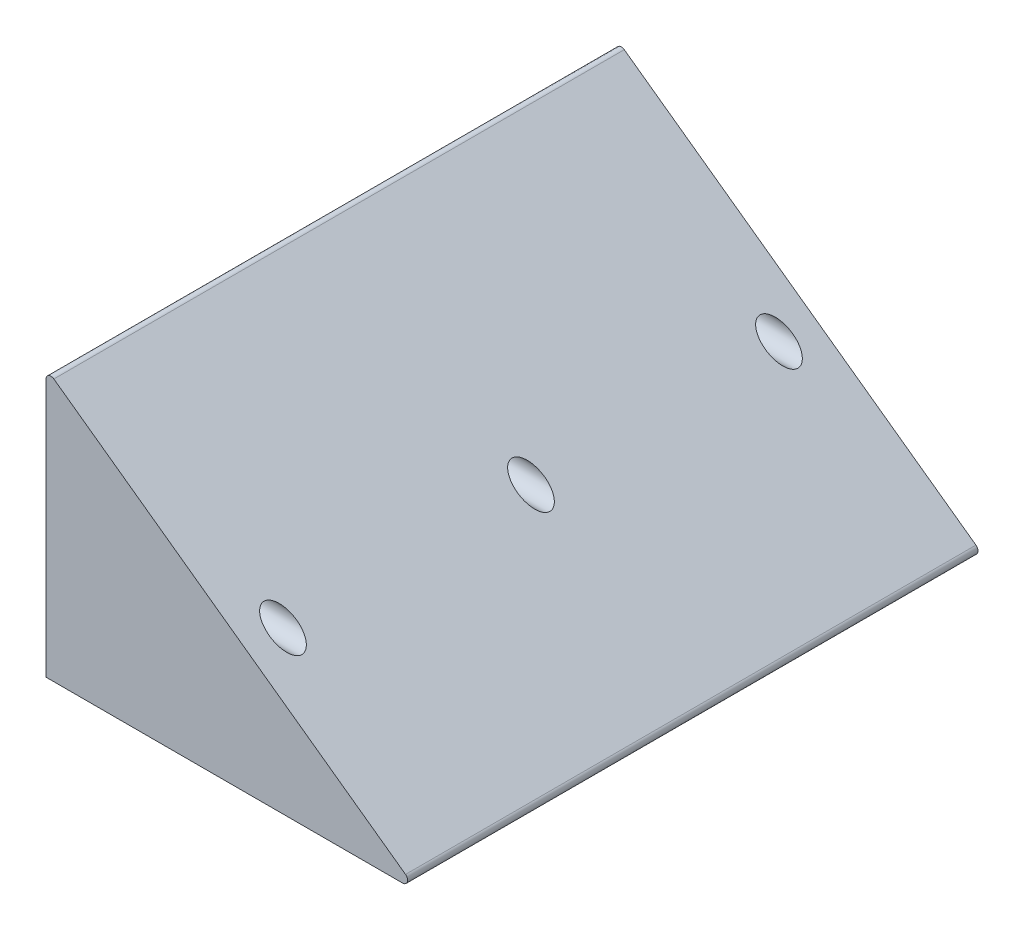
ISO-10303-21;
HEADER;
FILE_DESCRIPTION(('STEP AP214'),'2;1');
FILE_NAME('part.step','',(''),(''),'','','');
FILE_SCHEMA(('AUTOMOTIVE_DESIGN { 1 0 10303 214 1 1 1 1 }'));
ENDSEC;
DATA;
#1=APPLICATION_CONTEXT('core data for automotive mechanical design processes');
#2=APPLICATION_PROTOCOL_DEFINITION('international standard','automotive_design',2000,#1);
#3=PRODUCT_CONTEXT('',#1,'mechanical');
#4=PRODUCT('Part','Part','',(#3));
#5=PRODUCT_RELATED_PRODUCT_CATEGORY('part','',(#4));
#6=PRODUCT_DEFINITION_FORMATION('','',#4);
#7=PRODUCT_DEFINITION_CONTEXT('part definition',#1,'design');
#8=PRODUCT_DEFINITION('design','',#6,#7);
#9=PRODUCT_DEFINITION_SHAPE('','',#8);
#10=(LENGTH_UNIT() NAMED_UNIT(*) SI_UNIT(.MILLI.,.METRE.));
#11=(NAMED_UNIT(*) PLANE_ANGLE_UNIT() SI_UNIT($,.RADIAN.));
#12=(NAMED_UNIT(*) SI_UNIT($,.STERADIAN.) SOLID_ANGLE_UNIT());
#13=UNCERTAINTY_MEASURE_WITH_UNIT(LENGTH_MEASURE(1.E-05),#10,'distance_accuracy_value','');
#14=(GEOMETRIC_REPRESENTATION_CONTEXT(3) GLOBAL_UNCERTAINTY_ASSIGNED_CONTEXT((#13)) GLOBAL_UNIT_ASSIGNED_CONTEXT((#10,
#11,#12)) REPRESENTATION_CONTEXT('',''));
#15=CARTESIAN_POINT('',(0.,0.,0.));
#16=DIRECTION('',(0.,0.,1.));
#17=DIRECTION('',(1.,0.,0.));
#18=AXIS2_PLACEMENT_3D('',#15,#16,#17);
#19=CARTESIAN_POINT('',(0.,0.,-230.));
#20=DIRECTION('',(0.,-1.,0.));
#21=DIRECTION('',(0.,0.,-1.));
#22=AXIS2_PLACEMENT_3D('',#19,#20,#21);
#23=PLANE('',#22);
#24=DIRECTION('',(1.,0.,0.));
#25=VECTOR('',#24,1.);
#26=CARTESIAN_POINT('',(0.,0.,0.));
#27=LINE('',#26,#25);
#28=CARTESIAN_POINT('',(0.,0.,0.));
#29=VERTEX_POINT('',#28);
#30=CARTESIAN_POINT('',(143.799350710944,0.,0.));
#31=VERTEX_POINT('',#30);
#32=EDGE_CURVE('E119',#29,#31,#27,.T.);
#33=ORIENTED_EDGE('',*,*,#32,.F.);
#34=DIRECTION('',(0.,0.,1.));
#35=VECTOR('',#34,1.);
#36=CARTESIAN_POINT('',(0.,0.,-230.));
#37=LINE('',#36,#35);
#38=CARTESIAN_POINT('',(0.,0.,-230.));
#39=VERTEX_POINT('',#38);
#40=EDGE_CURVE('E11',#39,#29,#37,.T.);
#41=ORIENTED_EDGE('',*,*,#40,.F.);
#42=DIRECTION('',(1.,0.,0.));
#43=VECTOR('',#42,1.);
#44=CARTESIAN_POINT('',(0.,0.,-230.));
#45=LINE('',#44,#43);
#46=CARTESIAN_POINT('',(143.799350710944,0.,-230.));
#47=VERTEX_POINT('',#46);
#48=EDGE_CURVE('E114',#39,#47,#45,.T.);
#49=ORIENTED_EDGE('',*,*,#48,.T.);
#50=DIRECTION('',(0.,0.,1.));
#51=VECTOR('',#50,1.);
#52=CARTESIAN_POINT('',(143.799350710944,0.,-230.));
#53=LINE('',#52,#51);
#54=EDGE_CURVE('E87',#47,#31,#53,.T.);
#55=ORIENTED_EDGE('',*,*,#54,.T.);
#56=EDGE_LOOP('',(#33,#41,#49,#55));
#57=FACE_BOUND('',#56,.T.);
#58=ADVANCED_FACE('F39',(#57),#23,.T.);
#59=CARTESIAN_POINT('',(0.,104.09553251188,-230.));
#60=DIRECTION('',(-1.,0.,0.));
#61=DIRECTION('',(0.,-1.,0.));
#62=AXIS2_PLACEMENT_3D('',#59,#60,#61);
#63=PLANE('',#62);
#64=CARTESIAN_POINT('',(0.,50.,-15.));
#65=DIRECTION('',(1.,0.,0.));
#66=DIRECTION('',(0.,0.,-1.));
#67=AXIS2_PLACEMENT_3D('',#64,#65,#66);
#68=CIRCLE('',#67,3.29999999999995);
#69=CARTESIAN_POINT('',(0.,50.,-18.3));
#70=VERTEX_POINT('',#69);
#71=EDGE_CURVE('E237',#70,#70,#68,.T.);
#72=ORIENTED_EDGE('',*,*,#71,.T.);
#73=EDGE_LOOP('',(#72));
#74=FACE_BOUND('',#73,.T.);
#75=CARTESIAN_POINT('',(0.,50.,-115.));
#76=DIRECTION('',(1.,0.,0.));
#77=DIRECTION('',(0.,0.,-1.));
#78=AXIS2_PLACEMENT_3D('',#75,#76,#77);
#79=CIRCLE('',#78,3.29999999999995);
#80=CARTESIAN_POINT('',(0.,50.,-118.3));
#81=VERTEX_POINT('',#80);
#82=EDGE_CURVE('E144',#81,#81,#79,.T.);
#83=ORIENTED_EDGE('',*,*,#82,.T.);
#84=EDGE_LOOP('',(#83));
#85=FACE_BOUND('',#84,.T.);
#86=CARTESIAN_POINT('',(0.,50.,-215.));
#87=DIRECTION('',(1.,0.,0.));
#88=DIRECTION('',(0.,0.,-1.));
#89=AXIS2_PLACEMENT_3D('',#86,#87,#88);
#90=CIRCLE('',#89,3.29999999999995);
#91=CARTESIAN_POINT('',(0.,50.,-218.3));
#92=VERTEX_POINT('',#91);
#93=EDGE_CURVE('E139',#92,#92,#90,.T.);
#94=ORIENTED_EDGE('',*,*,#93,.T.);
#95=EDGE_LOOP('',(#94));
#96=FACE_BOUND('',#95,.T.);
#97=DIRECTION('',(0.,-1.,0.));
#98=VECTOR('',#97,1.);
#99=CARTESIAN_POINT('',(0.,104.09553251188,0.));
#100=LINE('',#99,#98);
#101=CARTESIAN_POINT('',(0.,104.09553251188,0.));
#102=VERTEX_POINT('',#101);
#103=EDGE_CURVE('E129',#102,#29,#100,.T.);
#104=ORIENTED_EDGE('',*,*,#103,.F.);
#105=DIRECTION('',(0.,0.,1.));
#106=VECTOR('',#105,1.);
#107=CARTESIAN_POINT('',(0.,104.09553251188,-230.));
#108=LINE('',#107,#106);
#109=CARTESIAN_POINT('',(0.,104.09553251188,-230.));
#110=VERTEX_POINT('',#109);
#111=EDGE_CURVE('E49',#110,#102,#108,.T.);
#112=ORIENTED_EDGE('',*,*,#111,.F.);
#113=DIRECTION('',(0.,-1.,0.));
#114=VECTOR('',#113,1.);
#115=CARTESIAN_POINT('',(0.,104.09553251188,-230.));
#116=LINE('',#115,#114);
#117=EDGE_CURVE('E109',#110,#39,#116,.T.);
#118=ORIENTED_EDGE('',*,*,#117,.T.);
#119=ORIENTED_EDGE('',*,*,#40,.T.);
#120=EDGE_LOOP('',(#104,#112,#118,#119));
#121=FACE_BOUND('',#120,.T.);
#122=ADVANCED_FACE('F165',(#74,#85,#96,#121),#63,.T.);
#123=CARTESIAN_POINT('',(2.,104.09553251188,-230.));
#124=DIRECTION('',(0.,0.,1.));
#125=DIRECTION('',(1.,0.,0.));
#126=AXIS2_PLACEMENT_3D('',#123,#124,#125);
#127=CYLINDRICAL_SURFACE('',#126,2.);
#128=CARTESIAN_POINT('',(2.,104.09553251188,0.));
#129=DIRECTION('',(0.,0.,1.));
#130=DIRECTION('',(-1.,0.,0.));
#131=AXIS2_PLACEMENT_3D('',#128,#129,#130);
#132=CIRCLE('',#131,2.);
#133=CARTESIAN_POINT('',(3.16860945169017,105.718601194783,0.));
#134=VERTEX_POINT('',#133);
#135=EDGE_CURVE('E97',#134,#102,#132,.T.);
#136=ORIENTED_EDGE('',*,*,#135,.F.);
#137=DIRECTION('',(0.,0.,1.));
#138=VECTOR('',#137,1.);
#139=CARTESIAN_POINT('',(3.16860945169017,105.718601194783,-230.));
#140=LINE('',#139,#138);
#141=CARTESIAN_POINT('',(3.16860945169017,105.718601194783,-230.));
#142=VERTEX_POINT('',#141);
#143=EDGE_CURVE('E92',#142,#134,#140,.T.);
#144=ORIENTED_EDGE('',*,*,#143,.F.);
#145=CARTESIAN_POINT('',(2.,104.09553251188,-230.));
#146=DIRECTION('',(0.,0.,1.));
#147=DIRECTION('',(-1.,0.,0.));
#148=AXIS2_PLACEMENT_3D('',#145,#146,#147);
#149=CIRCLE('',#148,2.);
#150=EDGE_CURVE('E95',#142,#110,#149,.T.);
#151=ORIENTED_EDGE('',*,*,#150,.T.);
#152=ORIENTED_EDGE('',*,*,#111,.T.);
#153=EDGE_LOOP('',(#136,#144,#151,#152));
#154=FACE_BOUND('',#153,.T.);
#155=ADVANCED_FACE('F94',(#154),#127,.T.);
#156=CARTESIAN_POINT('',(144.967960162635,3.62306868290303,-230.));
#157=DIRECTION('',(0.584304725845076,0.811534341451494,0.));
#158=DIRECTION('',(-0.811534341451495,0.584304725845076,0.));
#159=AXIS2_PLACEMENT_3D('',#156,#157,#158);
#160=PLANE('',#159);
#161=CARTESIAN_POINT('',(80.5555555555555,50.,-15.));
#162=DIRECTION('',(0.584304725845076,0.811534341451494,0.));
#163=DIRECTION('',(0.811534341451495,-0.584304725845076,0.));
#164=AXIS2_PLACEMENT_3D('',#161,#162,#163);
#165=ELLIPSE('',#164,9.41289665601348,5.49999999999999);
#166=CARTESIAN_POINT('',(88.1944444444444,44.5,-15.));
#167=VERTEX_POINT('',#166);
#168=EDGE_CURVE('E42',#167,#167,#165,.T.);
#169=ORIENTED_EDGE('',*,*,#168,.F.);
#170=EDGE_LOOP('',(#169));
#171=FACE_BOUND('',#170,.T.);
#172=CARTESIAN_POINT('',(80.5555555555555,50.,-115.));
#173=DIRECTION('',(0.584304725845076,0.811534341451494,0.));
#174=DIRECTION('',(0.811534341451495,-0.584304725845076,0.));
#175=AXIS2_PLACEMENT_3D('',#172,#173,#174);
#176=ELLIPSE('',#175,9.41289665601348,5.49999999999999);
#177=CARTESIAN_POINT('',(88.1944444444444,44.5,-115.));
#178=VERTEX_POINT('',#177);
#179=EDGE_CURVE('E140',#178,#178,#176,.T.);
#180=ORIENTED_EDGE('',*,*,#179,.F.);
#181=EDGE_LOOP('',(#180));
#182=FACE_BOUND('',#181,.T.);
#183=CARTESIAN_POINT('',(80.5555555555555,50.,-215.));
#184=DIRECTION('',(0.584304725845076,0.811534341451494,0.));
#185=DIRECTION('',(0.811534341451495,-0.584304725845076,0.));
#186=AXIS2_PLACEMENT_3D('',#183,#184,#185);
#187=ELLIPSE('',#186,9.41289665601348,5.49999999999999);
#188=CARTESIAN_POINT('',(88.1944444444444,44.5,-215.));
#189=VERTEX_POINT('',#188);
#190=EDGE_CURVE('E123',#189,#189,#187,.T.);
#191=ORIENTED_EDGE('',*,*,#190,.F.);
#192=EDGE_LOOP('',(#191));
#193=FACE_BOUND('',#192,.T.);
#194=DIRECTION('',(-0.811534341451494,0.584304725845076,0.));
#195=VECTOR('',#194,1.);
#196=CARTESIAN_POINT('',(144.967960162635,3.62306868290303,0.));
#197=LINE('',#196,#195);
#198=CARTESIAN_POINT('',(144.967960162635,3.62306868290303,0.));
#199=VERTEX_POINT('',#198);
#200=EDGE_CURVE('E126',#199,#134,#197,.T.);
#201=ORIENTED_EDGE('',*,*,#200,.F.);
#202=DIRECTION('',(0.,0.,1.));
#203=VECTOR('',#202,1.);
#204=CARTESIAN_POINT('',(144.967960162635,3.62306868290303,-230.));
#205=LINE('',#204,#203);
#206=CARTESIAN_POINT('',(144.967960162635,3.62306868290303,-230.));
#207=VERTEX_POINT('',#206);
#208=EDGE_CURVE('E103',#207,#199,#205,.T.);
#209=ORIENTED_EDGE('',*,*,#208,.F.);
#210=DIRECTION('',(-0.811534341451494,0.584304725845076,0.));
#211=VECTOR('',#210,1.);
#212=CARTESIAN_POINT('',(144.967960162635,3.62306868290303,-230.));
#213=LINE('',#212,#211);
#214=EDGE_CURVE('E108',#207,#142,#213,.T.);
#215=ORIENTED_EDGE('',*,*,#214,.T.);
#216=ORIENTED_EDGE('',*,*,#143,.T.);
#217=EDGE_LOOP('',(#201,#209,#215,#216));
#218=FACE_BOUND('',#217,.T.);
#219=ADVANCED_FACE('F111',(#171,#182,#193,#218),#160,.T.);
#220=CARTESIAN_POINT('',(143.799350710945,2.,-230.));
#221=DIRECTION('',(0.,0.,1.));
#222=DIRECTION('',(1.,0.,0.));
#223=AXIS2_PLACEMENT_3D('',#220,#221,#222);
#224=CYLINDRICAL_SURFACE('',#223,2.);
#225=CARTESIAN_POINT('',(143.799350710945,2.,0.));
#226=DIRECTION('',(0.,0.,1.));
#227=DIRECTION('',(1.,0.,0.));
#228=AXIS2_PLACEMENT_3D('',#225,#226,#227);
#229=CIRCLE('',#228,2.);
#230=EDGE_CURVE('E122',#31,#199,#229,.T.);
#231=ORIENTED_EDGE('',*,*,#230,.F.);
#232=ORIENTED_EDGE('',*,*,#54,.F.);
#233=CARTESIAN_POINT('',(143.799350710945,2.,-230.));
#234=DIRECTION('',(0.,0.,1.));
#235=DIRECTION('',(1.,0.,0.));
#236=AXIS2_PLACEMENT_3D('',#233,#234,#235);
#237=CIRCLE('',#236,2.);
#238=EDGE_CURVE('E112',#47,#207,#237,.T.);
#239=ORIENTED_EDGE('',*,*,#238,.T.);
#240=ORIENTED_EDGE('',*,*,#208,.T.);
#241=EDGE_LOOP('',(#231,#232,#239,#240));
#242=FACE_BOUND('',#241,.T.);
#243=ADVANCED_FACE('F168',(#242),#224,.T.);
#244=CARTESIAN_POINT('',(143.799350710945,2.,-230.));
#245=DIRECTION('',(0.,0.,1.));
#246=DIRECTION('',(1.,0.,0.));
#247=AXIS2_PLACEMENT_3D('',#244,#245,#246);
#248=PLANE('',#247);
#249=ORIENTED_EDGE('',*,*,#48,.F.);
#250=ORIENTED_EDGE('',*,*,#117,.F.);
#251=ORIENTED_EDGE('',*,*,#150,.F.);
#252=ORIENTED_EDGE('',*,*,#214,.F.);
#253=ORIENTED_EDGE('',*,*,#238,.F.);
#254=EDGE_LOOP('',(#249,#250,#251,#252,#253));
#255=FACE_BOUND('',#254,.T.);
#256=ADVANCED_FACE('F107',(#255),#248,.F.);
#257=CARTESIAN_POINT('',(143.799350710945,2.,0.));
#258=DIRECTION('',(0.,0.,1.));
#259=DIRECTION('',(1.,0.,0.));
#260=AXIS2_PLACEMENT_3D('',#257,#258,#259);
#261=PLANE('',#260);
#262=ORIENTED_EDGE('',*,*,#32,.T.);
#263=ORIENTED_EDGE('',*,*,#230,.T.);
#264=ORIENTED_EDGE('',*,*,#200,.T.);
#265=ORIENTED_EDGE('',*,*,#135,.T.);
#266=ORIENTED_EDGE('',*,*,#103,.T.);
#267=EDGE_LOOP('',(#262,#263,#264,#265,#266));
#268=FACE_BOUND('',#267,.T.);
#269=ADVANCED_FACE('F167',(#268),#261,.T.);
#270=CARTESIAN_POINT('',(150.,50.,-215.));
#271=DIRECTION('',(1.,0.,0.));
#272=DIRECTION('',(0.,0.,-1.));
#273=AXIS2_PLACEMENT_3D('',#270,#271,#272);
#274=CYLINDRICAL_SURFACE('',#273,3.29999999999996);
#275=ORIENTED_EDGE('',*,*,#93,.F.);
#276=EDGE_LOOP('',(#275));
#277=FACE_BOUND('',#276,.T.);
#278=CARTESIAN_POINT('',(43.6,50.,-215.));
#279=DIRECTION('',(1.,0.,0.));
#280=DIRECTION('',(0.,0.,-1.));
#281=AXIS2_PLACEMENT_3D('',#278,#279,#280);
#282=CIRCLE('',#281,3.29999999999998);
#283=CARTESIAN_POINT('',(43.6,50.,-218.3));
#284=VERTEX_POINT('',#283);
#285=EDGE_CURVE('E148',#284,#284,#282,.T.);
#286=ORIENTED_EDGE('',*,*,#285,.T.);
#287=EDGE_LOOP('',(#286));
#288=FACE_BOUND('',#287,.T.);
#289=ADVANCED_FACE('F190',(#277,#288),#274,.F.);
#290=CARTESIAN_POINT('',(43.6,53.3,-215.));
#291=DIRECTION('',(-1.,0.,0.));
#292=DIRECTION('',(0.,0.,1.));
#293=AXIS2_PLACEMENT_3D('',#290,#291,#292);
#294=PLANE('',#293);
#295=ORIENTED_EDGE('',*,*,#285,.F.);
#296=EDGE_LOOP('',(#295));
#297=FACE_BOUND('',#296,.T.);
#298=CARTESIAN_POINT('',(43.6,50.,-215.));
#299=DIRECTION('',(1.,0.,0.));
#300=DIRECTION('',(0.,0.,-1.));
#301=AXIS2_PLACEMENT_3D('',#298,#299,#300);
#302=CIRCLE('',#301,5.49999999999998);
#303=CARTESIAN_POINT('',(43.6,50.,-220.5));
#304=VERTEX_POINT('',#303);
#305=EDGE_CURVE('E143',#304,#304,#302,.T.);
#306=ORIENTED_EDGE('',*,*,#305,.T.);
#307=EDGE_LOOP('',(#306));
#308=FACE_BOUND('',#307,.T.);
#309=ADVANCED_FACE('F194',(#297,#308),#294,.F.);
#310=CARTESIAN_POINT('',(150.,50.,-215.));
#311=DIRECTION('',(1.,0.,0.));
#312=DIRECTION('',(0.,0.,-1.));
#313=AXIS2_PLACEMENT_3D('',#310,#311,#312);
#314=CYLINDRICAL_SURFACE('',#313,5.49999999999999);
#315=ORIENTED_EDGE('',*,*,#190,.T.);
#316=EDGE_LOOP('',(#315));
#317=FACE_BOUND('',#316,.T.);
#318=ORIENTED_EDGE('',*,*,#305,.F.);
#319=EDGE_LOOP('',(#318));
#320=FACE_BOUND('',#319,.T.);
#321=ADVANCED_FACE('F198',(#317,#320),#314,.F.);
#322=CARTESIAN_POINT('',(150.,50.,-115.));
#323=DIRECTION('',(1.,0.,0.));
#324=DIRECTION('',(0.,0.,-1.));
#325=AXIS2_PLACEMENT_3D('',#322,#323,#324);
#326=CYLINDRICAL_SURFACE('',#325,3.29999999999996);
#327=ORIENTED_EDGE('',*,*,#82,.F.);
#328=EDGE_LOOP('',(#327));
#329=FACE_BOUND('',#328,.T.);
#330=CARTESIAN_POINT('',(43.6,50.,-115.));
#331=DIRECTION('',(1.,0.,0.));
#332=DIRECTION('',(0.,0.,-1.));
#333=AXIS2_PLACEMENT_3D('',#330,#331,#332);
#334=CIRCLE('',#333,3.29999999999998);
#335=CARTESIAN_POINT('',(43.6,50.,-118.3));
#336=VERTEX_POINT('',#335);
#337=EDGE_CURVE('E152',#336,#336,#334,.T.);
#338=ORIENTED_EDGE('',*,*,#337,.T.);
#339=EDGE_LOOP('',(#338));
#340=FACE_BOUND('',#339,.T.);
#341=ADVANCED_FACE('F202',(#329,#340),#326,.F.);
#342=CARTESIAN_POINT('',(43.6,53.3,-115.));
#343=DIRECTION('',(-1.,0.,0.));
#344=DIRECTION('',(0.,0.,1.));
#345=AXIS2_PLACEMENT_3D('',#342,#343,#344);
#346=PLANE('',#345);
#347=ORIENTED_EDGE('',*,*,#337,.F.);
#348=EDGE_LOOP('',(#347));
#349=FACE_BOUND('',#348,.T.);
#350=CARTESIAN_POINT('',(43.6,50.,-115.));
#351=DIRECTION('',(1.,0.,0.));
#352=DIRECTION('',(0.,0.,-1.));
#353=AXIS2_PLACEMENT_3D('',#350,#351,#352);
#354=CIRCLE('',#353,5.49999999999998);
#355=CARTESIAN_POINT('',(43.6,50.,-120.5));
#356=VERTEX_POINT('',#355);
#357=EDGE_CURVE('E158',#356,#356,#354,.T.);
#358=ORIENTED_EDGE('',*,*,#357,.T.);
#359=EDGE_LOOP('',(#358));
#360=FACE_BOUND('',#359,.T.);
#361=ADVANCED_FACE('F206',(#349,#360),#346,.F.);
#362=CARTESIAN_POINT('',(150.,50.,-115.));
#363=DIRECTION('',(1.,0.,0.));
#364=DIRECTION('',(0.,0.,-1.));
#365=AXIS2_PLACEMENT_3D('',#362,#363,#364);
#366=CYLINDRICAL_SURFACE('',#365,5.49999999999999);
#367=ORIENTED_EDGE('',*,*,#179,.T.);
#368=EDGE_LOOP('',(#367));
#369=FACE_BOUND('',#368,.T.);
#370=ORIENTED_EDGE('',*,*,#357,.F.);
#371=EDGE_LOOP('',(#370));
#372=FACE_BOUND('',#371,.T.);
#373=ADVANCED_FACE('F210',(#369,#372),#366,.F.);
#374=CARTESIAN_POINT('',(150.,50.,-15.));
#375=DIRECTION('',(1.,0.,0.));
#376=DIRECTION('',(0.,0.,-1.));
#377=AXIS2_PLACEMENT_3D('',#374,#375,#376);
#378=CYLINDRICAL_SURFACE('',#377,3.29999999999996);
#379=ORIENTED_EDGE('',*,*,#71,.F.);
#380=EDGE_LOOP('',(#379));
#381=FACE_BOUND('',#380,.T.);
#382=CARTESIAN_POINT('',(43.6,50.,-15.));
#383=DIRECTION('',(1.,0.,0.));
#384=DIRECTION('',(0.,0.,-1.));
#385=AXIS2_PLACEMENT_3D('',#382,#383,#384);
#386=CIRCLE('',#385,3.29999999999998);
#387=CARTESIAN_POINT('',(43.6,50.,-18.3));
#388=VERTEX_POINT('',#387);
#389=EDGE_CURVE('E234',#388,#388,#386,.T.);
#390=ORIENTED_EDGE('',*,*,#389,.T.);
#391=EDGE_LOOP('',(#390));
#392=FACE_BOUND('',#391,.T.);
#393=ADVANCED_FACE('F214',(#381,#392),#378,.F.);
#394=CARTESIAN_POINT('',(43.6,53.3,-15.));
#395=DIRECTION('',(-1.,0.,0.));
#396=DIRECTION('',(0.,0.,1.));
#397=AXIS2_PLACEMENT_3D('',#394,#395,#396);
#398=PLANE('',#397);
#399=ORIENTED_EDGE('',*,*,#389,.F.);
#400=EDGE_LOOP('',(#399));
#401=FACE_BOUND('',#400,.T.);
#402=CARTESIAN_POINT('',(43.6,50.,-15.));
#403=DIRECTION('',(1.,0.,0.));
#404=DIRECTION('',(0.,0.,-1.));
#405=AXIS2_PLACEMENT_3D('',#402,#403,#404);
#406=CIRCLE('',#405,5.49999999999998);
#407=CARTESIAN_POINT('',(43.6,50.,-20.5));
#408=VERTEX_POINT('',#407);
#409=EDGE_CURVE('E232',#408,#408,#406,.T.);
#410=ORIENTED_EDGE('',*,*,#409,.T.);
#411=EDGE_LOOP('',(#410));
#412=FACE_BOUND('',#411,.T.);
#413=ADVANCED_FACE('F217',(#401,#412),#398,.F.);
#414=CARTESIAN_POINT('',(150.,50.,-15.));
#415=DIRECTION('',(1.,0.,0.));
#416=DIRECTION('',(0.,0.,-1.));
#417=AXIS2_PLACEMENT_3D('',#414,#415,#416);
#418=CYLINDRICAL_SURFACE('',#417,5.49999999999999);
#419=ORIENTED_EDGE('',*,*,#168,.T.);
#420=EDGE_LOOP('',(#419));
#421=FACE_BOUND('',#420,.T.);
#422=ORIENTED_EDGE('',*,*,#409,.F.);
#423=EDGE_LOOP('',(#422));
#424=FACE_BOUND('',#423,.T.);
#425=ADVANCED_FACE('F221',(#421,#424),#418,.F.);
#426=CLOSED_SHELL('',(#58,#122,#155,#219,#243,#256,#269,#289,#309,#321,#341,#361,#373,#393,#413,#425));
#427=MANIFOLD_SOLID_BREP('B2',#426);
#428=ADVANCED_BREP_SHAPE_REPRESENTATION('',(#18,#427),#14);
#429=SHAPE_DEFINITION_REPRESENTATION(#9,#428);
ENDSEC;
END-ISO-10303-21;
